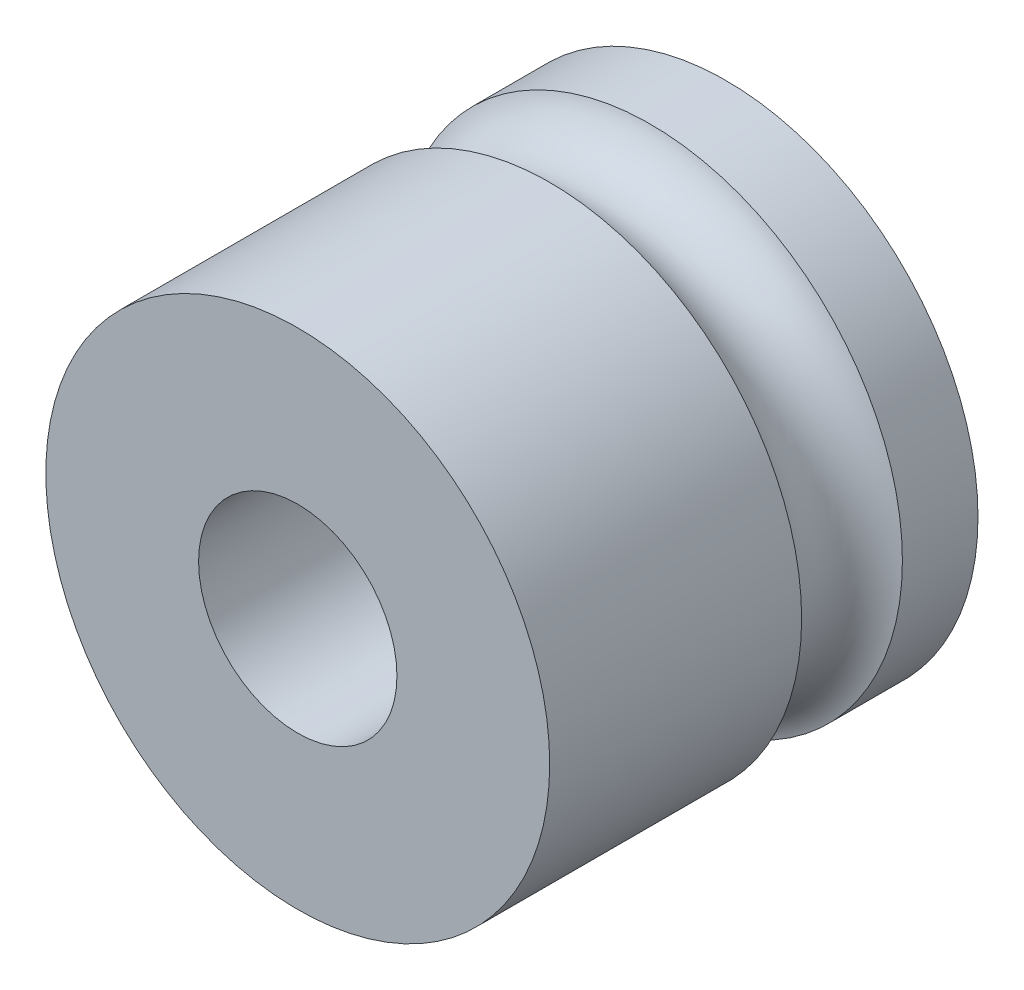
ISO-10303-21;
HEADER;
FILE_DESCRIPTION(('STEP AP214'),'2;1');
FILE_NAME('part.step','',(''),(''),'','','');
FILE_SCHEMA(('AUTOMOTIVE_DESIGN { 1 0 10303 214 1 1 1 1 }'));
ENDSEC;
DATA;
#1=APPLICATION_CONTEXT('core data for automotive mechanical design processes');
#2=APPLICATION_PROTOCOL_DEFINITION('international standard','automotive_design',2000,#1);
#3=PRODUCT_CONTEXT('',#1,'mechanical');
#4=PRODUCT('Part','Part','',(#3));
#5=PRODUCT_RELATED_PRODUCT_CATEGORY('part','',(#4));
#6=PRODUCT_DEFINITION_FORMATION('','',#4);
#7=PRODUCT_DEFINITION_CONTEXT('part definition',#1,'design');
#8=PRODUCT_DEFINITION('design','',#6,#7);
#9=PRODUCT_DEFINITION_SHAPE('','',#8);
#10=(LENGTH_UNIT() NAMED_UNIT(*) SI_UNIT(.MILLI.,.METRE.));
#11=(NAMED_UNIT(*) PLANE_ANGLE_UNIT() SI_UNIT($,.RADIAN.));
#12=(NAMED_UNIT(*) SI_UNIT($,.STERADIAN.) SOLID_ANGLE_UNIT());
#13=UNCERTAINTY_MEASURE_WITH_UNIT(LENGTH_MEASURE(1.E-05),#10,'distance_accuracy_value','');
#14=(GEOMETRIC_REPRESENTATION_CONTEXT(3) GLOBAL_UNCERTAINTY_ASSIGNED_CONTEXT((#13)) GLOBAL_UNIT_ASSIGNED_CONTEXT((#10,
#11,#12)) REPRESENTATION_CONTEXT('',''));
#15=CARTESIAN_POINT('',(0.,0.,0.));
#16=DIRECTION('',(0.,0.,1.));
#17=DIRECTION('',(1.,0.,0.));
#18=AXIS2_PLACEMENT_3D('',#15,#16,#17);
#19=CARTESIAN_POINT('',(4.425,0.,0.));
#20=DIRECTION('',(0.,0.,-1.));
#21=DIRECTION('',(-1.,0.,0.));
#22=AXIS2_PLACEMENT_3D('',#19,#20,#21);
#23=PLANE('',#22);
#24=CARTESIAN_POINT('',(0.,0.,0.));
#25=DIRECTION('',(0.,0.,1.));
#26=DIRECTION('',(1.,0.,0.));
#27=AXIS2_PLACEMENT_3D('',#24,#25,#26);
#28=CIRCLE('',#27,6.35);
#29=CARTESIAN_POINT('',(6.35,0.,0.));
#30=VERTEX_POINT('',#29);
#31=EDGE_CURVE('E22',#30,#30,#28,.T.);
#32=ORIENTED_EDGE('',*,*,#31,.F.);
#33=EDGE_LOOP('',(#32));
#34=FACE_BOUND('',#33,.T.);
#35=CARTESIAN_POINT('',(0.,0.,0.));
#36=DIRECTION('',(0.,0.,1.));
#37=DIRECTION('',(1.,0.,0.));
#38=AXIS2_PLACEMENT_3D('',#35,#36,#37);
#39=CIRCLE('',#38,2.5);
#40=CARTESIAN_POINT('',(2.5,0.,0.));
#41=VERTEX_POINT('',#40);
#42=EDGE_CURVE('E10',#41,#41,#39,.T.);
#43=ORIENTED_EDGE('',*,*,#42,.T.);
#44=EDGE_LOOP('',(#43));
#45=FACE_BOUND('',#44,.T.);
#46=ADVANCED_FACE('F14',(#34,#45),#23,.T.);
#47=CARTESIAN_POINT('',(0.,0.,0.952499999999998));
#48=DIRECTION('',(0.,0.,1.));
#49=DIRECTION('',(1.,0.,0.));
#50=AXIS2_PLACEMENT_3D('',#47,#48,#49);
#51=CYLINDRICAL_SURFACE('',#50,6.35);
#52=CARTESIAN_POINT('',(0.,0.,1.905));
#53=DIRECTION('',(0.,0.,1.));
#54=DIRECTION('',(1.,0.,0.));
#55=AXIS2_PLACEMENT_3D('',#52,#53,#54);
#56=CIRCLE('',#55,6.35);
#57=CARTESIAN_POINT('',(6.35,0.,1.905));
#58=VERTEX_POINT('',#57);
#59=EDGE_CURVE('E27',#58,#58,#56,.T.);
#60=ORIENTED_EDGE('',*,*,#59,.F.);
#61=EDGE_LOOP('',(#60));
#62=FACE_BOUND('',#61,.T.);
#63=ORIENTED_EDGE('',*,*,#31,.T.);
#64=EDGE_LOOP('',(#63));
#65=FACE_BOUND('',#64,.T.);
#66=ADVANCED_FACE('F57',(#62,#65),#51,.T.);
#67=CARTESIAN_POINT('',(0.,0.,3.175));
#68=DIRECTION('',(0.,0.,1.));
#69=DIRECTION('',(1.,0.,0.));
#70=AXIS2_PLACEMENT_3D('',#67,#68,#69);
#71=TOROIDAL_SURFACE('',#70,6.72041666666667,1.32291666666667);
#72=ORIENTED_EDGE('',*,*,#59,.T.);
#73=EDGE_LOOP('',(#72));
#74=FACE_BOUND('',#73,.T.);
#75=CARTESIAN_POINT('',(0.,0.,4.445));
#76=DIRECTION('',(0.,0.,1.));
#77=DIRECTION('',(1.,0.,0.));
#78=AXIS2_PLACEMENT_3D('',#75,#76,#77);
#79=CIRCLE('',#78,6.35);
#80=CARTESIAN_POINT('',(6.35,0.,4.445));
#81=VERTEX_POINT('',#80);
#82=EDGE_CURVE('E32',#81,#81,#79,.T.);
#83=ORIENTED_EDGE('',*,*,#82,.F.);
#84=EDGE_LOOP('',(#83));
#85=FACE_BOUND('',#84,.T.);
#86=ADVANCED_FACE('F52',(#74,#85),#71,.F.);
#87=CARTESIAN_POINT('',(0.,0.,7.62));
#88=DIRECTION('',(0.,0.,1.));
#89=DIRECTION('',(1.,0.,0.));
#90=AXIS2_PLACEMENT_3D('',#87,#88,#89);
#91=CYLINDRICAL_SURFACE('',#90,6.35);
#92=CARTESIAN_POINT('',(0.,0.,10.795));
#93=DIRECTION('',(0.,0.,1.));
#94=DIRECTION('',(1.,0.,0.));
#95=AXIS2_PLACEMENT_3D('',#92,#93,#94);
#96=CIRCLE('',#95,6.35);
#97=CARTESIAN_POINT('',(6.35,0.,10.795));
#98=VERTEX_POINT('',#97);
#99=EDGE_CURVE('E34',#98,#98,#96,.T.);
#100=ORIENTED_EDGE('',*,*,#99,.F.);
#101=EDGE_LOOP('',(#100));
#102=FACE_BOUND('',#101,.T.);
#103=ORIENTED_EDGE('',*,*,#82,.T.);
#104=EDGE_LOOP('',(#103));
#105=FACE_BOUND('',#104,.T.);
#106=ADVANCED_FACE('F16',(#102,#105),#91,.T.);
#107=CARTESIAN_POINT('',(4.425,0.,10.795));
#108=DIRECTION('',(0.,0.,1.));
#109=DIRECTION('',(1.,0.,0.));
#110=AXIS2_PLACEMENT_3D('',#107,#108,#109);
#111=PLANE('',#110);
#112=CARTESIAN_POINT('',(0.,0.,10.795));
#113=DIRECTION('',(0.,0.,1.));
#114=DIRECTION('',(1.,0.,0.));
#115=AXIS2_PLACEMENT_3D('',#112,#113,#114);
#116=CIRCLE('',#115,2.5);
#117=CARTESIAN_POINT('',(2.5,0.,10.795));
#118=VERTEX_POINT('',#117);
#119=EDGE_CURVE('E18',#118,#118,#116,.T.);
#120=ORIENTED_EDGE('',*,*,#119,.F.);
#121=EDGE_LOOP('',(#120));
#122=FACE_BOUND('',#121,.T.);
#123=ORIENTED_EDGE('',*,*,#99,.T.);
#124=EDGE_LOOP('',(#123));
#125=FACE_BOUND('',#124,.T.);
#126=ADVANCED_FACE('F43',(#122,#125),#111,.T.);
#127=CARTESIAN_POINT('',(0.,0.,5.3975));
#128=DIRECTION('',(0.,0.,1.));
#129=DIRECTION('',(1.,0.,0.));
#130=AXIS2_PLACEMENT_3D('',#127,#128,#129);
#131=CYLINDRICAL_SURFACE('',#130,2.5);
#132=ORIENTED_EDGE('',*,*,#42,.F.);
#133=EDGE_LOOP('',(#132));
#134=FACE_BOUND('',#133,.T.);
#135=ORIENTED_EDGE('',*,*,#119,.T.);
#136=EDGE_LOOP('',(#135));
#137=FACE_BOUND('',#136,.T.);
#138=ADVANCED_FACE('F41',(#134,#137),#131,.F.);
#139=CLOSED_SHELL('',(#46,#66,#86,#106,#126,#138));
#140=MANIFOLD_SOLID_BREP('B1',#139);
#141=ADVANCED_BREP_SHAPE_REPRESENTATION('',(#18,#140),#14);
#142=SHAPE_DEFINITION_REPRESENTATION(#9,#141);
ENDSEC;
END-ISO-10303-21;
